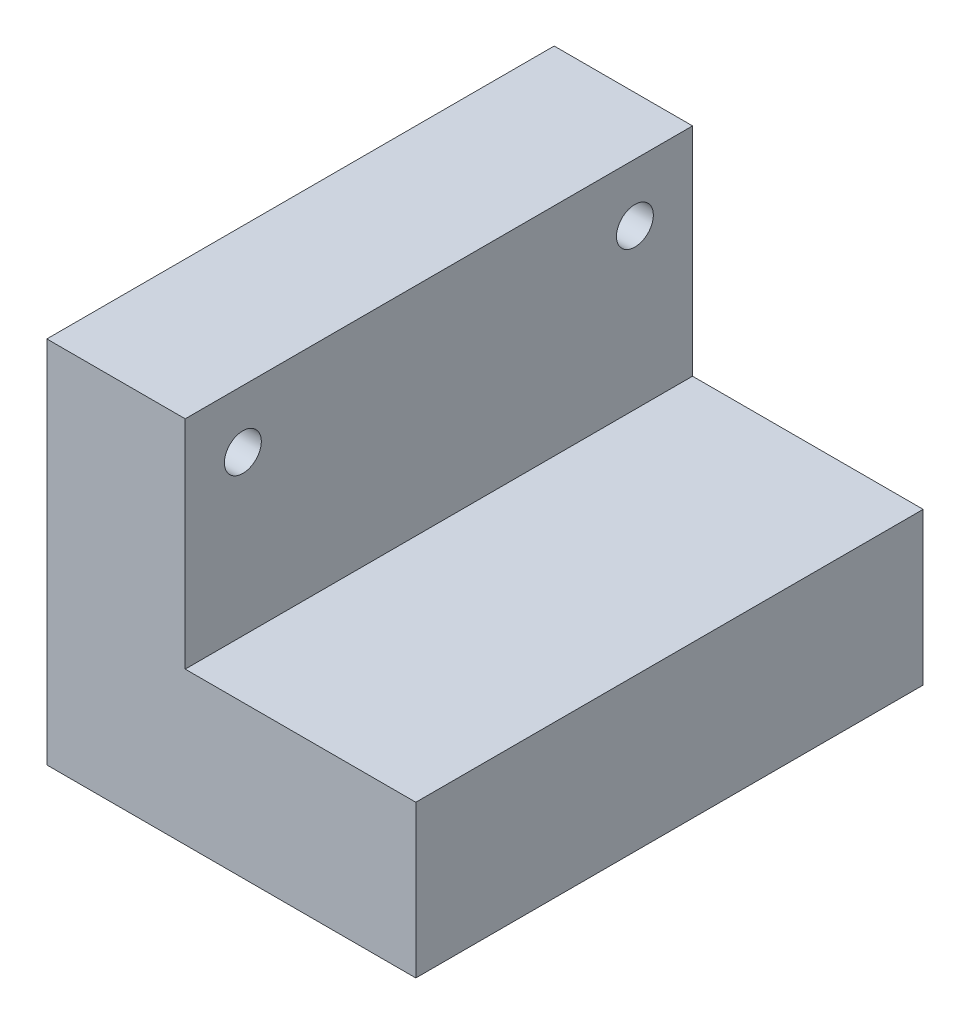
ISO-10303-21;
HEADER;
FILE_DESCRIPTION(('STEP AP214'),'2;1');
FILE_NAME('part.step','',(''),(''),'','','');
FILE_SCHEMA(('AUTOMOTIVE_DESIGN { 1 0 10303 214 1 1 1 1 }'));
ENDSEC;
DATA;
#1=APPLICATION_CONTEXT('core data for automotive mechanical design processes');
#2=APPLICATION_PROTOCOL_DEFINITION('international standard','automotive_design',2000,#1);
#3=PRODUCT_CONTEXT('',#1,'mechanical');
#4=PRODUCT('Part','Part','',(#3));
#5=PRODUCT_RELATED_PRODUCT_CATEGORY('part','',(#4));
#6=PRODUCT_DEFINITION_FORMATION('','',#4);
#7=PRODUCT_DEFINITION_CONTEXT('part definition',#1,'design');
#8=PRODUCT_DEFINITION('design','',#6,#7);
#9=PRODUCT_DEFINITION_SHAPE('','',#8);
#10=(LENGTH_UNIT() NAMED_UNIT(*) SI_UNIT(.MILLI.,.METRE.));
#11=(NAMED_UNIT(*) PLANE_ANGLE_UNIT() SI_UNIT($,.RADIAN.));
#12=(NAMED_UNIT(*) SI_UNIT($,.STERADIAN.) SOLID_ANGLE_UNIT());
#13=UNCERTAINTY_MEASURE_WITH_UNIT(LENGTH_MEASURE(1.E-05),#10,'distance_accuracy_value','');
#14=(GEOMETRIC_REPRESENTATION_CONTEXT(3) GLOBAL_UNCERTAINTY_ASSIGNED_CONTEXT((#13)) GLOBAL_UNIT_ASSIGNED_CONTEXT((#10,
#11,#12)) REPRESENTATION_CONTEXT('',''));
#15=CARTESIAN_POINT('',(0.,0.,0.));
#16=DIRECTION('',(0.,0.,1.));
#17=DIRECTION('',(1.,0.,0.));
#18=AXIS2_PLACEMENT_3D('',#15,#16,#17);
#19=CARTESIAN_POINT('',(-29.0441176470588,80.,-55.6066176470588));
#20=DIRECTION('',(1.,0.,0.));
#21=DIRECTION('',(0.,0.,-1.));
#22=AXIS2_PLACEMENT_3D('',#19,#20,#21);
#23=PLANE('',#22);
#24=CARTESIAN_POINT('',(-29.0441176470588,67.5,41.8933823529412));
#25=DIRECTION('',(-1.,0.,0.));
#26=DIRECTION('',(0.,0.,1.));
#27=AXIS2_PLACEMENT_3D('',#24,#25,#26);
#28=CIRCLE('',#27,4.00000000000001);
#29=CARTESIAN_POINT('',(-29.0441176470588,67.5,45.8933823529412));
#30=VERTEX_POINT('',#29);
#31=EDGE_CURVE('E127',#30,#30,#28,.T.);
#32=ORIENTED_EDGE('',*,*,#31,.F.);
#33=EDGE_LOOP('',(#32));
#34=FACE_BOUND('',#33,.T.);
#35=CARTESIAN_POINT('',(-29.0441176470588,67.5,-43.1066176470588));
#36=DIRECTION('',(-1.,0.,0.));
#37=DIRECTION('',(0.,0.,1.));
#38=AXIS2_PLACEMENT_3D('',#35,#36,#37);
#39=CIRCLE('',#38,4.00000000000001);
#40=CARTESIAN_POINT('',(-29.0441176470588,67.5,-39.1066176470588));
#41=VERTEX_POINT('',#40);
#42=EDGE_CURVE('E135',#41,#41,#39,.T.);
#43=ORIENTED_EDGE('',*,*,#42,.F.);
#44=EDGE_LOOP('',(#43));
#45=FACE_BOUND('',#44,.T.);
#46=DIRECTION('',(0.,0.,1.));
#47=VECTOR('',#46,1.);
#48=CARTESIAN_POINT('',(-29.0441176470588,0.,-55.6066176470588));
#49=LINE('',#48,#47);
#50=CARTESIAN_POINT('',(-29.0441176470588,0.,-55.6066176470588));
#51=VERTEX_POINT('',#50);
#52=CARTESIAN_POINT('',(-29.0441176470588,0.,54.3933823529412));
#53=VERTEX_POINT('',#52);
#54=EDGE_CURVE('E102',#51,#53,#49,.T.);
#55=ORIENTED_EDGE('',*,*,#54,.T.);
#56=DIRECTION('',(0.,-1.,0.));
#57=VECTOR('',#56,1.);
#58=CARTESIAN_POINT('',(-29.0441176470588,80.,54.3933823529412));
#59=LINE('',#58,#57);
#60=CARTESIAN_POINT('',(-29.0441176470588,80.,54.3933823529412));
#61=VERTEX_POINT('',#60);
#62=EDGE_CURVE('E11',#61,#53,#59,.T.);
#63=ORIENTED_EDGE('',*,*,#62,.F.);
#64=DIRECTION('',(0.,0.,1.));
#65=VECTOR('',#64,1.);
#66=CARTESIAN_POINT('',(-29.0441176470588,80.,-55.6066176470588));
#67=LINE('',#66,#65);
#68=CARTESIAN_POINT('',(-29.0441176470588,80.,-55.6066176470588));
#69=VERTEX_POINT('',#68);
#70=EDGE_CURVE('E96',#69,#61,#67,.T.);
#71=ORIENTED_EDGE('',*,*,#70,.F.);
#72=DIRECTION('',(0.,-1.,0.));
#73=VECTOR('',#72,1.);
#74=CARTESIAN_POINT('',(-29.0441176470588,80.,-55.6066176470588));
#75=LINE('',#74,#73);
#76=EDGE_CURVE('E86',#69,#51,#75,.T.);
#77=ORIENTED_EDGE('',*,*,#76,.T.);
#78=EDGE_LOOP('',(#55,#63,#71,#77));
#79=FACE_BOUND('',#78,.T.);
#80=ADVANCED_FACE('F39',(#34,#45,#79),#23,.F.);
#81=CARTESIAN_POINT('',(-29.0441176470588,80.,54.3933823529412));
#82=DIRECTION('',(0.,0.,-1.));
#83=DIRECTION('',(-1.,0.,0.));
#84=AXIS2_PLACEMENT_3D('',#81,#82,#83);
#85=PLANE('',#84);
#86=DIRECTION('',(1.,0.,0.));
#87=VECTOR('',#86,1.);
#88=CARTESIAN_POINT('',(50.9558823529412,33.,54.3933823529412));
#89=LINE('',#88,#87);
#90=CARTESIAN_POINT('',(0.955882352941181,33.,54.3933823529412));
#91=VERTEX_POINT('',#90);
#92=CARTESIAN_POINT('',(50.9558823529412,33.,54.3933823529412));
#93=VERTEX_POINT('',#92);
#94=EDGE_CURVE('E155',#91,#93,#89,.T.);
#95=ORIENTED_EDGE('',*,*,#94,.F.);
#96=DIRECTION('',(0.,1.,0.));
#97=VECTOR('',#96,1.);
#98=CARTESIAN_POINT('',(0.955882352941181,33.,54.3933823529412));
#99=LINE('',#98,#97);
#100=CARTESIAN_POINT('',(0.955882352941181,80.,54.3933823529412));
#101=VERTEX_POINT('',#100);
#102=EDGE_CURVE('E109',#91,#101,#99,.T.);
#103=ORIENTED_EDGE('',*,*,#102,.T.);
#104=DIRECTION('',(1.,0.,0.));
#105=VECTOR('',#104,1.);
#106=CARTESIAN_POINT('',(-29.0441176470588,80.,54.3933823529412));
#107=LINE('',#106,#105);
#108=EDGE_CURVE('E164',#61,#101,#107,.T.);
#109=ORIENTED_EDGE('',*,*,#108,.F.);
#110=ORIENTED_EDGE('',*,*,#62,.T.);
#111=DIRECTION('',(1.,0.,0.));
#112=VECTOR('',#111,1.);
#113=CARTESIAN_POINT('',(-29.0441176470588,0.,54.3933823529412));
#114=LINE('',#113,#112);
#115=CARTESIAN_POINT('',(50.9558823529412,0.,54.3933823529412));
#116=VERTEX_POINT('',#115);
#117=EDGE_CURVE('E107',#53,#116,#114,.T.);
#118=ORIENTED_EDGE('',*,*,#117,.T.);
#119=DIRECTION('',(0.,-1.,0.));
#120=VECTOR('',#119,1.);
#121=CARTESIAN_POINT('',(50.9558823529412,80.,54.3933823529412));
#122=LINE('',#121,#120);
#123=EDGE_CURVE('E48',#93,#116,#122,.T.);
#124=ORIENTED_EDGE('',*,*,#123,.F.);
#125=EDGE_LOOP('',(#95,#103,#109,#110,#118,#124));
#126=FACE_BOUND('',#125,.T.);
#127=ADVANCED_FACE('F173',(#126),#85,.F.);
#128=CARTESIAN_POINT('',(50.9558823529412,80.,-55.6066176470588));
#129=DIRECTION('',(-1.,0.,0.));
#130=DIRECTION('',(0.,0.,1.));
#131=AXIS2_PLACEMENT_3D('',#128,#129,#130);
#132=PLANE('',#131);
#133=DIRECTION('',(0.,-1.,0.));
#134=VECTOR('',#133,1.);
#135=CARTESIAN_POINT('',(50.9558823529412,80.,-55.6066176470588));
#136=LINE('',#135,#134);
#137=CARTESIAN_POINT('',(50.9558823529412,33.,-55.6066176470588));
#138=VERTEX_POINT('',#137);
#139=CARTESIAN_POINT('',(50.9558823529412,0.,-55.6066176470588));
#140=VERTEX_POINT('',#139);
#141=EDGE_CURVE('E90',#138,#140,#136,.T.);
#142=ORIENTED_EDGE('',*,*,#141,.F.);
#143=DIRECTION('',(0.,0.,-1.));
#144=VECTOR('',#143,1.);
#145=CARTESIAN_POINT('',(50.9558823529412,33.,-55.6066176470588));
#146=LINE('',#145,#144);
#147=EDGE_CURVE('E143',#93,#138,#146,.T.);
#148=ORIENTED_EDGE('',*,*,#147,.F.);
#149=ORIENTED_EDGE('',*,*,#123,.T.);
#150=DIRECTION('',(0.,0.,-1.));
#151=VECTOR('',#150,1.);
#152=CARTESIAN_POINT('',(50.9558823529412,0.,-55.6066176470588));
#153=LINE('',#152,#151);
#154=EDGE_CURVE('E97',#116,#140,#153,.T.);
#155=ORIENTED_EDGE('',*,*,#154,.T.);
#156=EDGE_LOOP('',(#142,#148,#149,#155));
#157=FACE_BOUND('',#156,.T.);
#158=ADVANCED_FACE('F186',(#157),#132,.F.);
#159=CARTESIAN_POINT('',(-29.0441176470588,80.,-55.6066176470588));
#160=DIRECTION('',(0.,0.,1.));
#161=DIRECTION('',(1.,0.,0.));
#162=AXIS2_PLACEMENT_3D('',#159,#160,#161);
#163=PLANE('',#162);
#164=DIRECTION('',(-1.,0.,0.));
#165=VECTOR('',#164,1.);
#166=CARTESIAN_POINT('',(-29.0441176470588,80.,-55.6066176470588));
#167=LINE('',#166,#165);
#168=CARTESIAN_POINT('',(0.955882352941168,80.,-55.6066176470588));
#169=VERTEX_POINT('',#168);
#170=EDGE_CURVE('E64',#169,#69,#167,.T.);
#171=ORIENTED_EDGE('',*,*,#170,.F.);
#172=DIRECTION('',(0.,1.,0.));
#173=VECTOR('',#172,1.);
#174=CARTESIAN_POINT('',(0.955882352941168,33.,-55.6066176470588));
#175=LINE('',#174,#173);
#176=CARTESIAN_POINT('',(0.955882352941168,33.,-55.6066176470588));
#177=VERTEX_POINT('',#176);
#178=EDGE_CURVE('E56',#177,#169,#175,.T.);
#179=ORIENTED_EDGE('',*,*,#178,.F.);
#180=DIRECTION('',(-1.,0.,0.));
#181=VECTOR('',#180,1.);
#182=CARTESIAN_POINT('',(50.9558823529412,33.,-55.6066176470588));
#183=LINE('',#182,#181);
#184=EDGE_CURVE('E147',#138,#177,#183,.T.);
#185=ORIENTED_EDGE('',*,*,#184,.F.);
#186=ORIENTED_EDGE('',*,*,#141,.T.);
#187=DIRECTION('',(-1.,0.,0.));
#188=VECTOR('',#187,1.);
#189=CARTESIAN_POINT('',(-29.0441176470588,0.,-55.6066176470588));
#190=LINE('',#189,#188);
#191=EDGE_CURVE('E83',#140,#51,#190,.T.);
#192=ORIENTED_EDGE('',*,*,#191,.T.);
#193=ORIENTED_EDGE('',*,*,#76,.F.);
#194=EDGE_LOOP('',(#171,#179,#185,#186,#192,#193));
#195=FACE_BOUND('',#194,.T.);
#196=ADVANCED_FACE('F85',(#195),#163,.F.);
#197=CARTESIAN_POINT('',(0.,80.,0.));
#198=DIRECTION('',(0.,1.,0.));
#199=DIRECTION('',(0.,0.,1.));
#200=AXIS2_PLACEMENT_3D('',#197,#198,#199);
#201=PLANE('',#200);
#202=DIRECTION('',(0.,0.,1.));
#203=VECTOR('',#202,1.);
#204=CARTESIAN_POINT('',(0.955882352941168,80.,-55.6066176470588));
#205=LINE('',#204,#203);
#206=EDGE_CURVE('E133',#169,#101,#205,.T.);
#207=ORIENTED_EDGE('',*,*,#206,.F.);
#208=ORIENTED_EDGE('',*,*,#170,.T.);
#209=ORIENTED_EDGE('',*,*,#70,.T.);
#210=ORIENTED_EDGE('',*,*,#108,.T.);
#211=EDGE_LOOP('',(#207,#208,#209,#210));
#212=FACE_BOUND('',#211,.T.);
#213=ADVANCED_FACE('F169',(#212),#201,.T.);
#214=CARTESIAN_POINT('',(0.,0.,0.));
#215=DIRECTION('',(0.,1.,0.));
#216=DIRECTION('',(0.,0.,1.));
#217=AXIS2_PLACEMENT_3D('',#214,#215,#216);
#218=PLANE('',#217);
#219=ORIENTED_EDGE('',*,*,#54,.F.);
#220=ORIENTED_EDGE('',*,*,#191,.F.);
#221=ORIENTED_EDGE('',*,*,#154,.F.);
#222=ORIENTED_EDGE('',*,*,#117,.F.);
#223=EDGE_LOOP('',(#219,#220,#221,#222));
#224=FACE_BOUND('',#223,.T.);
#225=ADVANCED_FACE('F105',(#224),#218,.F.);
#226=CARTESIAN_POINT('',(0.955882352941168,33.,-55.6066176470588));
#227=DIRECTION('',(-1.,0.,0.));
#228=DIRECTION('',(0.,0.,1.));
#229=AXIS2_PLACEMENT_3D('',#226,#227,#228);
#230=PLANE('',#229);
#231=CARTESIAN_POINT('',(0.955882352941181,67.5,41.8933823529412));
#232=DIRECTION('',(-1.,0.,0.));
#233=DIRECTION('',(0.,0.,1.));
#234=AXIS2_PLACEMENT_3D('',#231,#232,#233);
#235=CIRCLE('',#234,4.00000000000001);
#236=CARTESIAN_POINT('',(0.955882352941182,67.5,45.8933823529412));
#237=VERTEX_POINT('',#236);
#238=EDGE_CURVE('E42',#237,#237,#235,.T.);
#239=ORIENTED_EDGE('',*,*,#238,.T.);
#240=EDGE_LOOP('',(#239));
#241=FACE_BOUND('',#240,.T.);
#242=CARTESIAN_POINT('',(0.955882352941168,67.5,-43.1066176470588));
#243=DIRECTION('',(-1.,0.,0.));
#244=DIRECTION('',(0.,0.,1.));
#245=AXIS2_PLACEMENT_3D('',#242,#243,#244);
#246=CIRCLE('',#245,4.00000000000001);
#247=CARTESIAN_POINT('',(0.955882352941168,67.5,-39.1066176470588));
#248=VERTEX_POINT('',#247);
#249=EDGE_CURVE('E124',#248,#248,#246,.T.);
#250=ORIENTED_EDGE('',*,*,#249,.T.);
#251=EDGE_LOOP('',(#250));
#252=FACE_BOUND('',#251,.T.);
#253=ORIENTED_EDGE('',*,*,#206,.T.);
#254=ORIENTED_EDGE('',*,*,#102,.F.);
#255=DIRECTION('',(0.,0.,1.));
#256=VECTOR('',#255,1.);
#257=CARTESIAN_POINT('',(0.955882352941168,33.,-55.6066176470588));
#258=LINE('',#257,#256);
#259=EDGE_CURVE('E151',#177,#91,#258,.T.);
#260=ORIENTED_EDGE('',*,*,#259,.F.);
#261=ORIENTED_EDGE('',*,*,#178,.T.);
#262=EDGE_LOOP('',(#253,#254,#260,#261));
#263=FACE_BOUND('',#262,.T.);
#264=ADVANCED_FACE('F177',(#241,#252,#263),#230,.F.);
#265=CARTESIAN_POINT('',(0.,33.,0.));
#266=DIRECTION('',(0.,-1.,0.));
#267=DIRECTION('',(0.,0.,-1.));
#268=AXIS2_PLACEMENT_3D('',#265,#266,#267);
#269=PLANE('',#268);
#270=ORIENTED_EDGE('',*,*,#147,.T.);
#271=ORIENTED_EDGE('',*,*,#184,.T.);
#272=ORIENTED_EDGE('',*,*,#259,.T.);
#273=ORIENTED_EDGE('',*,*,#94,.T.);
#274=EDGE_LOOP('',(#270,#271,#272,#273));
#275=FACE_BOUND('',#274,.T.);
#276=ADVANCED_FACE('F181',(#275),#269,.F.);
#277=CARTESIAN_POINT('',(50.9558823529412,67.5,-43.1066176470588));
#278=DIRECTION('',(-1.,0.,0.));
#279=DIRECTION('',(0.,0.,1.));
#280=AXIS2_PLACEMENT_3D('',#277,#278,#279);
#281=CYLINDRICAL_SURFACE('',#280,4.00000000000001);
#282=ORIENTED_EDGE('',*,*,#42,.T.);
#283=EDGE_LOOP('',(#282));
#284=FACE_BOUND('',#283,.T.);
#285=ORIENTED_EDGE('',*,*,#249,.F.);
#286=EDGE_LOOP('',(#285));
#287=FACE_BOUND('',#286,.T.);
#288=ADVANCED_FACE('F202',(#284,#287),#281,.F.);
#289=CARTESIAN_POINT('',(50.9558823529412,67.5,41.8933823529412));
#290=DIRECTION('',(-1.,0.,0.));
#291=DIRECTION('',(0.,0.,1.));
#292=AXIS2_PLACEMENT_3D('',#289,#290,#291);
#293=CYLINDRICAL_SURFACE('',#292,4.00000000000001);
#294=ORIENTED_EDGE('',*,*,#31,.T.);
#295=EDGE_LOOP('',(#294));
#296=FACE_BOUND('',#295,.T.);
#297=ORIENTED_EDGE('',*,*,#238,.F.);
#298=EDGE_LOOP('',(#297));
#299=FACE_BOUND('',#298,.T.);
#300=ADVANCED_FACE('F205',(#296,#299),#293,.F.);
#301=CLOSED_SHELL('',(#80,#127,#158,#196,#213,#225,#264,#276,#288,#300));
#302=MANIFOLD_SOLID_BREP('B2',#301);
#303=ADVANCED_BREP_SHAPE_REPRESENTATION('',(#18,#302),#14);
#304=SHAPE_DEFINITION_REPRESENTATION(#9,#303);
ENDSEC;
END-ISO-10303-21;
